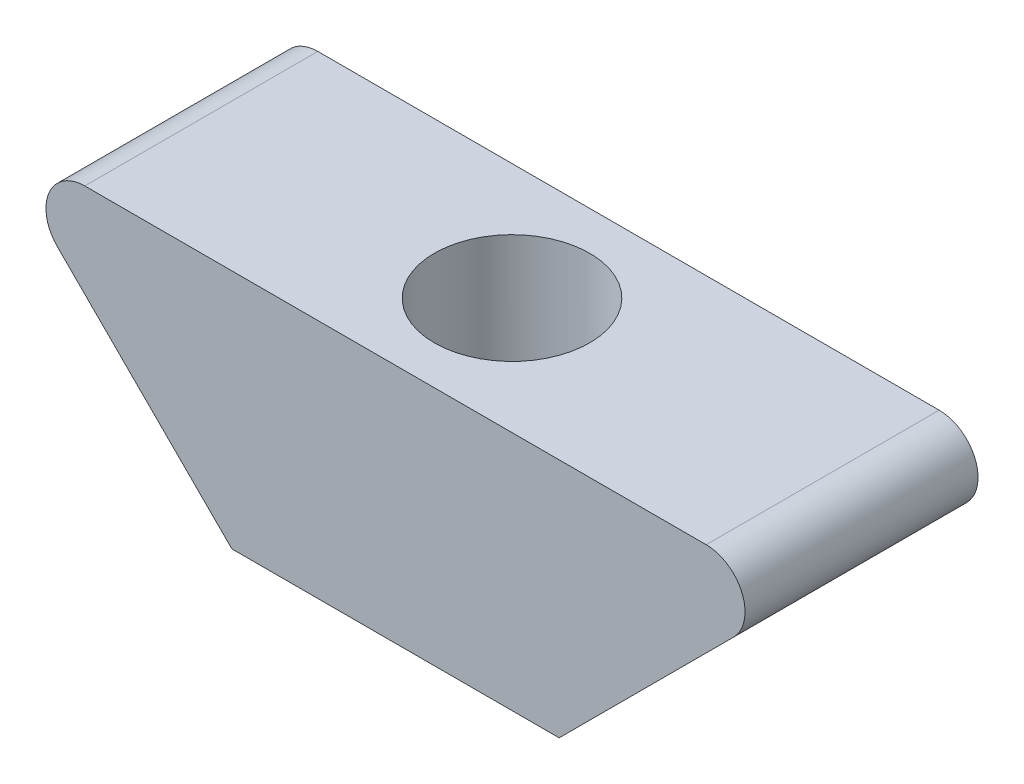
ISO-10303-21;
HEADER;
FILE_DESCRIPTION(('STEP AP214'),'2;1');
FILE_NAME('part.step','',(''),(''),'','','');
FILE_SCHEMA(('AUTOMOTIVE_DESIGN { 1 0 10303 214 1 1 1 1 }'));
ENDSEC;
DATA;
#1=APPLICATION_CONTEXT('core data for automotive mechanical design processes');
#2=APPLICATION_PROTOCOL_DEFINITION('international standard','automotive_design',2000,#1);
#3=PRODUCT_CONTEXT('',#1,'mechanical');
#4=PRODUCT('Part','Part','',(#3));
#5=PRODUCT_RELATED_PRODUCT_CATEGORY('part','',(#4));
#6=PRODUCT_DEFINITION_FORMATION('','',#4);
#7=PRODUCT_DEFINITION_CONTEXT('part definition',#1,'design');
#8=PRODUCT_DEFINITION('design','',#6,#7);
#9=PRODUCT_DEFINITION_SHAPE('','',#8);
#10=(LENGTH_UNIT() NAMED_UNIT(*) SI_UNIT(.MILLI.,.METRE.));
#11=(NAMED_UNIT(*) PLANE_ANGLE_UNIT() SI_UNIT($,.RADIAN.));
#12=(NAMED_UNIT(*) SI_UNIT($,.STERADIAN.) SOLID_ANGLE_UNIT());
#13=UNCERTAINTY_MEASURE_WITH_UNIT(LENGTH_MEASURE(1.E-05),#10,'distance_accuracy_value','');
#14=(GEOMETRIC_REPRESENTATION_CONTEXT(3) GLOBAL_UNCERTAINTY_ASSIGNED_CONTEXT((#13)) GLOBAL_UNIT_ASSIGNED_CONTEXT((#10,
#11,#12)) REPRESENTATION_CONTEXT('',''));
#15=CARTESIAN_POINT('',(0.,0.,0.));
#16=DIRECTION('',(0.,0.,1.));
#17=DIRECTION('',(1.,0.,0.));
#18=AXIS2_PLACEMENT_3D('',#15,#16,#17);
#19=CARTESIAN_POINT('',(8.,2.1,6.));
#20=DIRECTION('',(0.,0.,-1.));
#21=DIRECTION('',(-1.,0.,0.));
#22=AXIS2_PLACEMENT_3D('',#19,#20,#21);
#23=CYLINDRICAL_SURFACE('',#22,1.);
#24=CARTESIAN_POINT('',(8.,2.1,0.));
#25=DIRECTION('',(0.,0.,1.));
#26=DIRECTION('',(-1.,0.,0.));
#27=AXIS2_PLACEMENT_3D('',#24,#25,#26);
#28=CIRCLE('',#27,1.);
#29=CARTESIAN_POINT('',(8.70293914210264,1.38875,0.));
#30=VERTEX_POINT('',#29);
#31=CARTESIAN_POINT('',(8.,3.1,0.));
#32=VERTEX_POINT('',#31);
#33=EDGE_CURVE('E135',#30,#32,#28,.T.);
#34=ORIENTED_EDGE('',*,*,#33,.T.);
#35=DIRECTION('',(0.,0.,-1.));
#36=VECTOR('',#35,1.);
#37=CARTESIAN_POINT('',(8.,3.1,6.));
#38=LINE('',#37,#36);
#39=CARTESIAN_POINT('',(8.,3.1,6.));
#40=VERTEX_POINT('',#39);
#41=EDGE_CURVE('E11',#40,#32,#38,.T.);
#42=ORIENTED_EDGE('',*,*,#41,.F.);
#43=CARTESIAN_POINT('',(8.,2.1,6.));
#44=DIRECTION('',(0.,0.,1.));
#45=DIRECTION('',(-1.,0.,0.));
#46=AXIS2_PLACEMENT_3D('',#43,#44,#45);
#47=CIRCLE('',#46,1.);
#48=CARTESIAN_POINT('',(8.70293914210264,1.38875,6.));
#49=VERTEX_POINT('',#48);
#50=EDGE_CURVE('E151',#49,#40,#47,.T.);
#51=ORIENTED_EDGE('',*,*,#50,.F.);
#52=DIRECTION('',(0.,0.,-1.));
#53=VECTOR('',#52,1.);
#54=CARTESIAN_POINT('',(8.70293914210264,1.38875,6.));
#55=LINE('',#54,#53);
#56=EDGE_CURVE('E131',#49,#30,#55,.T.);
#57=ORIENTED_EDGE('',*,*,#56,.T.);
#58=EDGE_LOOP('',(#34,#42,#51,#57));
#59=FACE_BOUND('',#58,.T.);
#60=ADVANCED_FACE('F45',(#59),#23,.T.);
#61=CARTESIAN_POINT('',(-8.,3.1,6.));
#62=DIRECTION('',(0.,-1.,0.));
#63=DIRECTION('',(0.,0.,-1.));
#64=AXIS2_PLACEMENT_3D('',#61,#62,#63);
#65=PLANE('',#64);
#66=CARTESIAN_POINT('',(0.,3.1,3.));
#67=DIRECTION('',(0.,1.,0.));
#68=DIRECTION('',(0.,0.,1.));
#69=AXIS2_PLACEMENT_3D('',#66,#67,#68);
#70=CIRCLE('',#69,2.);
#71=CARTESIAN_POINT('',(0.,3.1,5.));
#72=VERTEX_POINT('',#71);
#73=EDGE_CURVE('E246',#72,#72,#70,.T.);
#74=ORIENTED_EDGE('',*,*,#73,.F.);
#75=EDGE_LOOP('',(#74));
#76=FACE_BOUND('',#75,.T.);
#77=DIRECTION('',(-1.,0.,0.));
#78=VECTOR('',#77,1.);
#79=CARTESIAN_POINT('',(-8.,3.1,0.));
#80=LINE('',#79,#78);
#81=CARTESIAN_POINT('',(-8.,3.1,0.));
#82=VERTEX_POINT('',#81);
#83=EDGE_CURVE('E139',#32,#82,#80,.T.);
#84=ORIENTED_EDGE('',*,*,#83,.T.);
#85=DIRECTION('',(0.,0.,-1.));
#86=VECTOR('',#85,1.);
#87=CARTESIAN_POINT('',(-8.,3.1,6.));
#88=LINE('',#87,#86);
#89=CARTESIAN_POINT('',(-8.,3.1,6.));
#90=VERTEX_POINT('',#89);
#91=EDGE_CURVE('E55',#90,#82,#88,.T.);
#92=ORIENTED_EDGE('',*,*,#91,.F.);
#93=DIRECTION('',(-1.,0.,0.));
#94=VECTOR('',#93,1.);
#95=CARTESIAN_POINT('',(-8.,3.1,6.));
#96=LINE('',#95,#94);
#97=EDGE_CURVE('E100',#40,#90,#96,.T.);
#98=ORIENTED_EDGE('',*,*,#97,.F.);
#99=ORIENTED_EDGE('',*,*,#41,.T.);
#100=EDGE_LOOP('',(#84,#92,#98,#99));
#101=FACE_BOUND('',#100,.T.);
#102=ADVANCED_FACE('F182',(#76,#101),#65,.F.);
#103=CARTESIAN_POINT('',(-8.,2.1,6.));
#104=DIRECTION('',(0.,0.,-1.));
#105=DIRECTION('',(-1.,0.,0.));
#106=AXIS2_PLACEMENT_3D('',#103,#104,#105);
#107=CYLINDRICAL_SURFACE('',#106,0.999999999999999);
#108=CARTESIAN_POINT('',(-8.,2.1,0.));
#109=DIRECTION('',(0.,0.,1.));
#110=DIRECTION('',(1.,0.,0.));
#111=AXIS2_PLACEMENT_3D('',#108,#109,#110);
#112=CIRCLE('',#111,0.999999999999999);
#113=CARTESIAN_POINT('',(-8.70293914210264,1.38875,0.));
#114=VERTEX_POINT('',#113);
#115=EDGE_CURVE('E142',#82,#114,#112,.T.);
#116=ORIENTED_EDGE('',*,*,#115,.T.);
#117=DIRECTION('',(0.,0.,-1.));
#118=VECTOR('',#117,1.);
#119=CARTESIAN_POINT('',(-8.70293914210264,1.38875,6.));
#120=LINE('',#119,#118);
#121=CARTESIAN_POINT('',(-8.70293914210264,1.38875,6.));
#122=VERTEX_POINT('',#121);
#123=EDGE_CURVE('E124',#122,#114,#120,.T.);
#124=ORIENTED_EDGE('',*,*,#123,.F.);
#125=CARTESIAN_POINT('',(-8.,2.1,6.));
#126=DIRECTION('',(0.,0.,1.));
#127=DIRECTION('',(1.,0.,0.));
#128=AXIS2_PLACEMENT_3D('',#125,#126,#127);
#129=CIRCLE('',#128,0.999999999999999);
#130=EDGE_CURVE('E113',#90,#122,#129,.T.);
#131=ORIENTED_EDGE('',*,*,#130,.F.);
#132=ORIENTED_EDGE('',*,*,#91,.T.);
#133=EDGE_LOOP('',(#116,#124,#131,#132));
#134=FACE_BOUND('',#133,.T.);
#135=ADVANCED_FACE('F162',(#134),#107,.T.);
#136=CARTESIAN_POINT('',(-8.70293914210264,1.38875,6.));
#137=DIRECTION('',(0.707106781186543,0.707106781186552,0.));
#138=DIRECTION('',(-0.707106781186552,0.707106781186543,0.));
#139=AXIS2_PLACEMENT_3D('',#136,#137,#138);
#140=PLANE('',#139);
#141=DIRECTION('',(0.707106781186552,-0.707106781186543,0.));
#142=VECTOR('',#141,1.);
#143=CARTESIAN_POINT('',(-8.70293914210264,1.38875,0.));
#144=LINE('',#143,#142);
#145=CARTESIAN_POINT('',(-4.21418914210259,-3.1,0.));
#146=VERTEX_POINT('',#145);
#147=EDGE_CURVE('E122',#114,#146,#144,.T.);
#148=ORIENTED_EDGE('',*,*,#147,.T.);
#149=DIRECTION('',(0.,0.,-1.));
#150=VECTOR('',#149,1.);
#151=CARTESIAN_POINT('',(-4.21418914210259,-3.1,6.));
#152=LINE('',#151,#150);
#153=CARTESIAN_POINT('',(-4.21418914210259,-3.1,6.));
#154=VERTEX_POINT('',#153);
#155=EDGE_CURVE('E119',#154,#146,#152,.T.);
#156=ORIENTED_EDGE('',*,*,#155,.F.);
#157=DIRECTION('',(0.707106781186552,-0.707106781186543,0.));
#158=VECTOR('',#157,1.);
#159=CARTESIAN_POINT('',(-8.70293914210264,1.38875,6.));
#160=LINE('',#159,#158);
#161=EDGE_CURVE('E107',#122,#154,#160,.T.);
#162=ORIENTED_EDGE('',*,*,#161,.F.);
#163=ORIENTED_EDGE('',*,*,#123,.T.);
#164=EDGE_LOOP('',(#148,#156,#162,#163));
#165=FACE_BOUND('',#164,.T.);
#166=ADVANCED_FACE('F120',(#165),#140,.F.);
#167=CARTESIAN_POINT('',(4.21418914210259,-3.1,6.));
#168=DIRECTION('',(0.,1.,0.));
#169=DIRECTION('',(-1.,0.,0.));
#170=AXIS2_PLACEMENT_3D('',#167,#168,#169);
#171=PLANE('',#170);
#172=CARTESIAN_POINT('',(0.,-3.1,3.));
#173=DIRECTION('',(0.,1.,0.));
#174=DIRECTION('',(-1.,0.,0.));
#175=AXIS2_PLACEMENT_3D('',#172,#173,#174);
#176=CIRCLE('',#175,2.);
#177=CARTESIAN_POINT('',(-2.,-3.1,3.));
#178=VERTEX_POINT('',#177);
#179=EDGE_CURVE('E48',#178,#178,#176,.T.);
#180=ORIENTED_EDGE('',*,*,#179,.T.);
#181=EDGE_LOOP('',(#180));
#182=FACE_BOUND('',#181,.T.);
#183=DIRECTION('',(1.,0.,0.));
#184=VECTOR('',#183,1.);
#185=CARTESIAN_POINT('',(4.21418914210259,-3.1,0.));
#186=LINE('',#185,#184);
#187=CARTESIAN_POINT('',(4.21418914210259,-3.1,0.));
#188=VERTEX_POINT('',#187);
#189=EDGE_CURVE('E86',#146,#188,#186,.T.);
#190=ORIENTED_EDGE('',*,*,#189,.T.);
#191=DIRECTION('',(0.,0.,-1.));
#192=VECTOR('',#191,1.);
#193=CARTESIAN_POINT('',(4.21418914210259,-3.1,6.));
#194=LINE('',#193,#192);
#195=CARTESIAN_POINT('',(4.21418914210259,-3.1,6.));
#196=VERTEX_POINT('',#195);
#197=EDGE_CURVE('E125',#196,#188,#194,.T.);
#198=ORIENTED_EDGE('',*,*,#197,.F.);
#199=DIRECTION('',(1.,0.,0.));
#200=VECTOR('',#199,1.);
#201=CARTESIAN_POINT('',(4.21418914210259,-3.1,6.));
#202=LINE('',#201,#200);
#203=EDGE_CURVE('E111',#154,#196,#202,.T.);
#204=ORIENTED_EDGE('',*,*,#203,.F.);
#205=ORIENTED_EDGE('',*,*,#155,.T.);
#206=EDGE_LOOP('',(#190,#198,#204,#205));
#207=FACE_BOUND('',#206,.T.);
#208=ADVANCED_FACE('F127',(#182,#207),#171,.F.);
#209=CARTESIAN_POINT('',(8.70293914210264,1.38875,6.));
#210=DIRECTION('',(-0.707106781186544,0.707106781186551,0.));
#211=DIRECTION('',(-0.707106781186551,-0.707106781186544,0.));
#212=AXIS2_PLACEMENT_3D('',#209,#210,#211);
#213=PLANE('',#212);
#214=DIRECTION('',(0.707106781186551,0.707106781186544,0.));
#215=VECTOR('',#214,1.);
#216=CARTESIAN_POINT('',(8.70293914210264,1.38875,0.));
#217=LINE('',#216,#215);
#218=EDGE_CURVE('E92',#188,#30,#217,.T.);
#219=ORIENTED_EDGE('',*,*,#218,.T.);
#220=ORIENTED_EDGE('',*,*,#56,.F.);
#221=DIRECTION('',(0.707106781186551,0.707106781186544,0.));
#222=VECTOR('',#221,1.);
#223=CARTESIAN_POINT('',(8.70293914210264,1.38875,6.));
#224=LINE('',#223,#222);
#225=EDGE_CURVE('E63',#196,#49,#224,.T.);
#226=ORIENTED_EDGE('',*,*,#225,.F.);
#227=ORIENTED_EDGE('',*,*,#197,.T.);
#228=EDGE_LOOP('',(#219,#220,#226,#227));
#229=FACE_BOUND('',#228,.T.);
#230=ADVANCED_FACE('F169',(#229),#213,.F.);
#231=CARTESIAN_POINT('',(8.,2.1,6.));
#232=DIRECTION('',(0.,0.,-1.));
#233=DIRECTION('',(-1.,0.,0.));
#234=AXIS2_PLACEMENT_3D('',#231,#232,#233);
#235=PLANE('',#234);
#236=ORIENTED_EDGE('',*,*,#50,.T.);
#237=ORIENTED_EDGE('',*,*,#97,.T.);
#238=ORIENTED_EDGE('',*,*,#130,.T.);
#239=ORIENTED_EDGE('',*,*,#161,.T.);
#240=ORIENTED_EDGE('',*,*,#203,.T.);
#241=ORIENTED_EDGE('',*,*,#225,.T.);
#242=EDGE_LOOP('',(#236,#237,#238,#239,#240,#241));
#243=FACE_BOUND('',#242,.T.);
#244=ADVANCED_FACE('F109',(#243),#235,.F.);
#245=CARTESIAN_POINT('',(8.,2.1,0.));
#246=DIRECTION('',(0.,0.,-1.));
#247=DIRECTION('',(-1.,0.,0.));
#248=AXIS2_PLACEMENT_3D('',#245,#246,#247);
#249=PLANE('',#248);
#250=ORIENTED_EDGE('',*,*,#33,.F.);
#251=ORIENTED_EDGE('',*,*,#218,.F.);
#252=ORIENTED_EDGE('',*,*,#189,.F.);
#253=ORIENTED_EDGE('',*,*,#147,.F.);
#254=ORIENTED_EDGE('',*,*,#115,.F.);
#255=ORIENTED_EDGE('',*,*,#83,.F.);
#256=EDGE_LOOP('',(#250,#251,#252,#253,#254,#255));
#257=FACE_BOUND('',#256,.T.);
#258=ADVANCED_FACE('F165',(#257),#249,.T.);
#259=CARTESIAN_POINT('',(0.,-4.9,3.));
#260=DIRECTION('',(0.,1.,0.));
#261=DIRECTION('',(0.,0.,1.));
#262=AXIS2_PLACEMENT_3D('',#259,#260,#261);
#263=CYLINDRICAL_SURFACE('',#262,2.);
#264=ORIENTED_EDGE('',*,*,#73,.T.);
#265=EDGE_LOOP('',(#264));
#266=FACE_BOUND('',#265,.T.);
#267=ORIENTED_EDGE('',*,*,#179,.F.);
#268=EDGE_LOOP('',(#267));
#269=FACE_BOUND('',#268,.T.);
#270=ADVANCED_FACE('F232',(#266,#269),#263,.F.);
#271=CLOSED_SHELL('',(#60,#102,#135,#166,#208,#230,#244,#258,#270));
#272=MANIFOLD_SOLID_BREP('B2',#271);
#273=ADVANCED_BREP_SHAPE_REPRESENTATION('',(#18,#272),#14);
#274=SHAPE_DEFINITION_REPRESENTATION(#9,#273);
ENDSEC;
END-ISO-10303-21;
